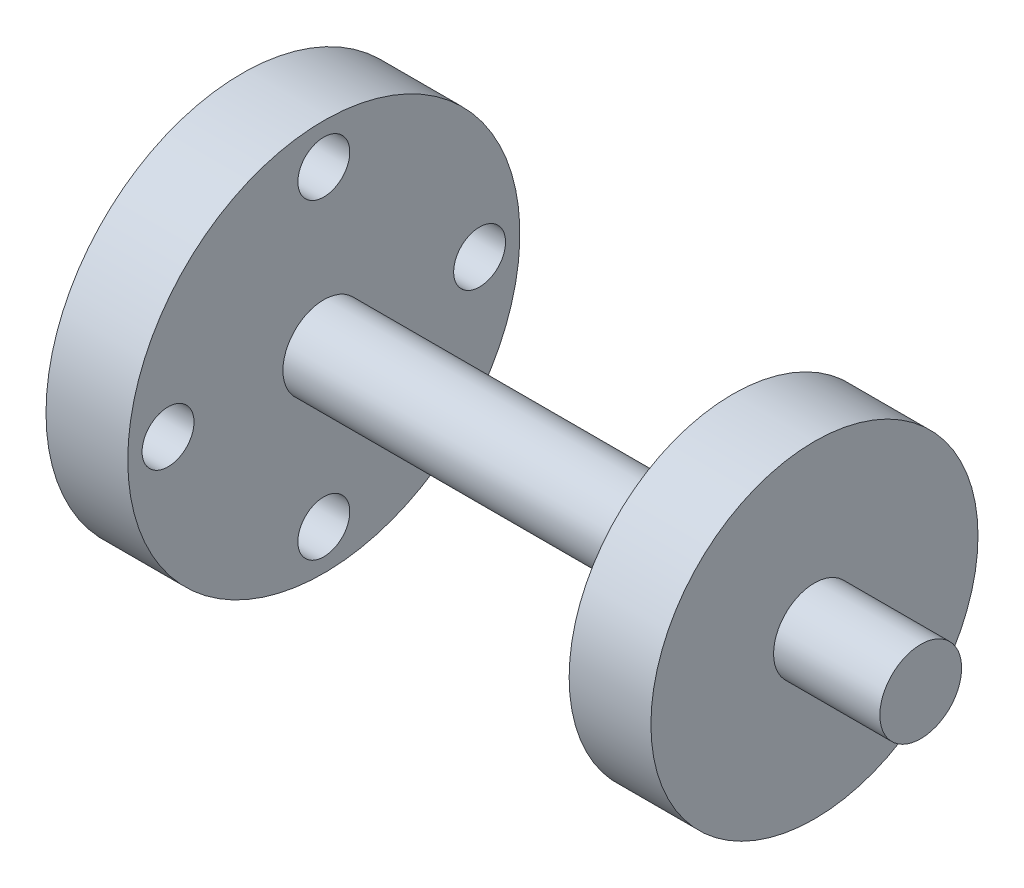
ISO-10303-21;
HEADER;
FILE_DESCRIPTION(('STEP AP214'),'2;1');
FILE_NAME('part.step','',(''),(''),'','','');
FILE_SCHEMA(('AUTOMOTIVE_DESIGN { 1 0 10303 214 1 1 1 1 }'));
ENDSEC;
DATA;
#1=APPLICATION_CONTEXT('core data for automotive mechanical design processes');
#2=APPLICATION_PROTOCOL_DEFINITION('international standard','automotive_design',2000,#1);
#3=PRODUCT_CONTEXT('',#1,'mechanical');
#4=PRODUCT('Part','Part','',(#3));
#5=PRODUCT_RELATED_PRODUCT_CATEGORY('part','',(#4));
#6=PRODUCT_DEFINITION_FORMATION('','',#4);
#7=PRODUCT_DEFINITION_CONTEXT('part definition',#1,'design');
#8=PRODUCT_DEFINITION('design','',#6,#7);
#9=PRODUCT_DEFINITION_SHAPE('','',#8);
#10=(LENGTH_UNIT() NAMED_UNIT(*) SI_UNIT(.MILLI.,.METRE.));
#11=(NAMED_UNIT(*) PLANE_ANGLE_UNIT() SI_UNIT($,.RADIAN.));
#12=(NAMED_UNIT(*) SI_UNIT($,.STERADIAN.) SOLID_ANGLE_UNIT());
#13=UNCERTAINTY_MEASURE_WITH_UNIT(LENGTH_MEASURE(1.E-05),#10,'distance_accuracy_value','');
#14=(GEOMETRIC_REPRESENTATION_CONTEXT(3) GLOBAL_UNCERTAINTY_ASSIGNED_CONTEXT((#13)) GLOBAL_UNIT_ASSIGNED_CONTEXT((#10,
#11,#12)) REPRESENTATION_CONTEXT('',''));
#15=CARTESIAN_POINT('',(0.,0.,0.));
#16=DIRECTION('',(0.,0.,1.));
#17=DIRECTION('',(1.,0.,0.));
#18=AXIS2_PLACEMENT_3D('',#15,#16,#17);
#19=CARTESIAN_POINT('',(83.,5.,0.));
#20=DIRECTION('',(-1.,0.,0.));
#21=DIRECTION('',(0.,0.,1.));
#22=AXIS2_PLACEMENT_3D('',#19,#20,#21);
#23=PLANE('',#22);
#24=CARTESIAN_POINT('',(83.,0.,0.));
#25=DIRECTION('',(-1.,0.,0.));
#26=DIRECTION('',(0.,0.,1.));
#27=AXIS2_PLACEMENT_3D('',#24,#25,#26);
#28=CIRCLE('',#27,5.);
#29=CARTESIAN_POINT('',(83.,0.,5.));
#30=VERTEX_POINT('',#29);
#31=EDGE_CURVE('E10',#30,#30,#28,.T.);
#32=ORIENTED_EDGE('',*,*,#31,.F.);
#33=EDGE_LOOP('',(#32));
#34=FACE_BOUND('',#33,.T.);
#35=ADVANCED_FACE('F43',(#34),#23,.F.);
#36=CARTESIAN_POINT('',(0.,0.,0.));
#37=DIRECTION('',(-1.,0.,0.));
#38=DIRECTION('',(0.,0.,1.));
#39=AXIS2_PLACEMENT_3D('',#36,#37,#38);
#40=CYLINDRICAL_SURFACE('',#39,5.);
#41=CARTESIAN_POINT('',(70.,0.,0.));
#42=DIRECTION('',(-1.,0.,0.));
#43=DIRECTION('',(0.,0.,1.));
#44=AXIS2_PLACEMENT_3D('',#41,#42,#43);
#45=CIRCLE('',#44,5.);
#46=CARTESIAN_POINT('',(70.,0.,5.));
#47=VERTEX_POINT('',#46);
#48=EDGE_CURVE('E50',#47,#47,#45,.T.);
#49=ORIENTED_EDGE('',*,*,#48,.F.);
#50=EDGE_LOOP('',(#49));
#51=FACE_BOUND('',#50,.T.);
#52=ORIENTED_EDGE('',*,*,#31,.T.);
#53=EDGE_LOOP('',(#52));
#54=FACE_BOUND('',#53,.T.);
#55=ADVANCED_FACE('F169',(#51,#54),#40,.T.);
#56=CARTESIAN_POINT('',(70.,5.,0.));
#57=DIRECTION('',(-1.,0.,0.));
#58=DIRECTION('',(0.,0.,1.));
#59=AXIS2_PLACEMENT_3D('',#56,#57,#58);
#60=PLANE('',#59);
#61=CARTESIAN_POINT('',(70.,0.,0.));
#62=DIRECTION('',(-1.,0.,0.));
#63=DIRECTION('',(0.,0.,1.));
#64=AXIS2_PLACEMENT_3D('',#61,#62,#63);
#65=CIRCLE('',#64,20.);
#66=CARTESIAN_POINT('',(70.,0.,20.));
#67=VERTEX_POINT('',#66);
#68=EDGE_CURVE('E55',#67,#67,#65,.T.);
#69=ORIENTED_EDGE('',*,*,#68,.F.);
#70=EDGE_LOOP('',(#69));
#71=FACE_BOUND('',#70,.T.);
#72=ORIENTED_EDGE('',*,*,#48,.T.);
#73=EDGE_LOOP('',(#72));
#74=FACE_BOUND('',#73,.T.);
#75=ADVANCED_FACE('F164',(#71,#74),#60,.F.);
#76=CARTESIAN_POINT('',(0.,0.,0.));
#77=DIRECTION('',(-1.,0.,0.));
#78=DIRECTION('',(0.,0.,1.));
#79=AXIS2_PLACEMENT_3D('',#76,#77,#78);
#80=CYLINDRICAL_SURFACE('',#79,20.);
#81=CARTESIAN_POINT('',(60.,0.,0.));
#82=DIRECTION('',(-1.,0.,0.));
#83=DIRECTION('',(0.,0.,1.));
#84=AXIS2_PLACEMENT_3D('',#81,#82,#83);
#85=CIRCLE('',#84,20.);
#86=CARTESIAN_POINT('',(60.,0.,20.));
#87=VERTEX_POINT('',#86);
#88=EDGE_CURVE('E60',#87,#87,#85,.T.);
#89=ORIENTED_EDGE('',*,*,#88,.F.);
#90=EDGE_LOOP('',(#89));
#91=FACE_BOUND('',#90,.T.);
#92=ORIENTED_EDGE('',*,*,#68,.T.);
#93=EDGE_LOOP('',(#92));
#94=FACE_BOUND('',#93,.T.);
#95=ADVANCED_FACE('F158',(#91,#94),#80,.T.);
#96=CARTESIAN_POINT('',(60.,20.,0.));
#97=DIRECTION('',(1.,0.,0.));
#98=DIRECTION('',(0.,0.,-1.));
#99=AXIS2_PLACEMENT_3D('',#96,#97,#98);
#100=PLANE('',#99);
#101=CARTESIAN_POINT('',(60.,0.,0.));
#102=DIRECTION('',(-1.,0.,0.));
#103=DIRECTION('',(0.,0.,1.));
#104=AXIS2_PLACEMENT_3D('',#101,#102,#103);
#105=CIRCLE('',#104,5.);
#106=CARTESIAN_POINT('',(60.,0.,5.));
#107=VERTEX_POINT('',#106);
#108=EDGE_CURVE('E66',#107,#107,#105,.T.);
#109=ORIENTED_EDGE('',*,*,#108,.F.);
#110=EDGE_LOOP('',(#109));
#111=FACE_BOUND('',#110,.T.);
#112=ORIENTED_EDGE('',*,*,#88,.T.);
#113=EDGE_LOOP('',(#112));
#114=FACE_BOUND('',#113,.T.);
#115=ADVANCED_FACE('F152',(#111,#114),#100,.F.);
#116=CARTESIAN_POINT('',(0.,0.,0.));
#117=DIRECTION('',(-1.,0.,0.));
#118=DIRECTION('',(0.,0.,1.));
#119=AXIS2_PLACEMENT_3D('',#116,#117,#118);
#120=CYLINDRICAL_SURFACE('',#119,4.99999999999999);
#121=CARTESIAN_POINT('',(9.99999999999999,0.,0.));
#122=DIRECTION('',(-1.,0.,0.));
#123=DIRECTION('',(0.,0.,1.));
#124=AXIS2_PLACEMENT_3D('',#121,#122,#123);
#125=CIRCLE('',#124,4.99999999999999);
#126=CARTESIAN_POINT('',(9.99999999999999,0.,4.99999999999999));
#127=VERTEX_POINT('',#126);
#128=EDGE_CURVE('E70',#127,#127,#125,.T.);
#129=ORIENTED_EDGE('',*,*,#128,.F.);
#130=EDGE_LOOP('',(#129));
#131=FACE_BOUND('',#130,.T.);
#132=ORIENTED_EDGE('',*,*,#108,.T.);
#133=EDGE_LOOP('',(#132));
#134=FACE_BOUND('',#133,.T.);
#135=ADVANCED_FACE('F146',(#131,#134),#120,.T.);
#136=CARTESIAN_POINT('',(9.99999999999999,4.99999999999999,0.));
#137=DIRECTION('',(-1.,0.,0.));
#138=DIRECTION('',(0.,0.,1.));
#139=AXIS2_PLACEMENT_3D('',#136,#137,#138);
#140=PLANE('',#139);
#141=CARTESIAN_POINT('',(10.,19.05,0.));
#142=DIRECTION('',(-1.,0.,0.));
#143=DIRECTION('',(0.,0.,1.));
#144=AXIS2_PLACEMENT_3D('',#141,#142,#143);
#145=CIRCLE('',#144,3.175);
#146=CARTESIAN_POINT('',(10.,19.05,3.175));
#147=VERTEX_POINT('',#146);
#148=EDGE_CURVE('E82',#147,#147,#145,.T.);
#149=ORIENTED_EDGE('',*,*,#148,.T.);
#150=EDGE_LOOP('',(#149));
#151=FACE_BOUND('',#150,.T.);
#152=CARTESIAN_POINT('',(10.,0.,19.05));
#153=DIRECTION('',(-1.,0.,0.));
#154=DIRECTION('',(0.,0.,1.));
#155=AXIS2_PLACEMENT_3D('',#152,#153,#154);
#156=CIRCLE('',#155,3.175);
#157=CARTESIAN_POINT('',(10.,0.,22.225));
#158=VERTEX_POINT('',#157);
#159=EDGE_CURVE('E99',#158,#158,#156,.T.);
#160=ORIENTED_EDGE('',*,*,#159,.T.);
#161=EDGE_LOOP('',(#160));
#162=FACE_BOUND('',#161,.T.);
#163=CARTESIAN_POINT('',(10.,-19.05,-1.33025439009923E-13));
#164=DIRECTION('',(-1.,0.,0.));
#165=DIRECTION('',(0.,0.,1.));
#166=AXIS2_PLACEMENT_3D('',#163,#164,#165);
#167=CIRCLE('',#166,3.175);
#168=CARTESIAN_POINT('',(10.,-19.05,3.17499999999987));
#169=VERTEX_POINT('',#168);
#170=EDGE_CURVE('E91',#169,#169,#167,.T.);
#171=ORIENTED_EDGE('',*,*,#170,.T.);
#172=EDGE_LOOP('',(#171));
#173=FACE_BOUND('',#172,.T.);
#174=CARTESIAN_POINT('',(10.,1.99538158514885E-13,-19.05));
#175=DIRECTION('',(-1.,0.,0.));
#176=DIRECTION('',(0.,0.,1.));
#177=AXIS2_PLACEMENT_3D('',#174,#175,#176);
#178=CIRCLE('',#177,3.175);
#179=CARTESIAN_POINT('',(10.,1.99538158514885E-13,-15.875));
#180=VERTEX_POINT('',#179);
#181=EDGE_CURVE('E83',#180,#180,#178,.T.);
#182=ORIENTED_EDGE('',*,*,#181,.T.);
#183=EDGE_LOOP('',(#182));
#184=FACE_BOUND('',#183,.T.);
#185=CARTESIAN_POINT('',(9.99999999999999,0.,0.));
#186=DIRECTION('',(-1.,0.,0.));
#187=DIRECTION('',(0.,0.,1.));
#188=AXIS2_PLACEMENT_3D('',#185,#186,#187);
#189=CIRCLE('',#188,23.975);
#190=CARTESIAN_POINT('',(9.99999999999999,0.,23.975));
#191=VERTEX_POINT('',#190);
#192=EDGE_CURVE('E74',#191,#191,#189,.T.);
#193=ORIENTED_EDGE('',*,*,#192,.F.);
#194=EDGE_LOOP('',(#193));
#195=FACE_BOUND('',#194,.T.);
#196=ORIENTED_EDGE('',*,*,#128,.T.);
#197=EDGE_LOOP('',(#196));
#198=FACE_BOUND('',#197,.T.);
#199=ADVANCED_FACE('F115',(#151,#162,#173,#184,#195,#198),#140,.F.);
#200=CARTESIAN_POINT('',(0.,0.,0.));
#201=DIRECTION('',(-1.,0.,0.));
#202=DIRECTION('',(0.,0.,1.));
#203=AXIS2_PLACEMENT_3D('',#200,#201,#202);
#204=CYLINDRICAL_SURFACE('',#203,23.975);
#205=CARTESIAN_POINT('',(0.,0.,0.));
#206=DIRECTION('',(-1.,0.,0.));
#207=DIRECTION('',(0.,0.,1.));
#208=AXIS2_PLACEMENT_3D('',#205,#206,#207);
#209=CIRCLE('',#208,23.975);
#210=CARTESIAN_POINT('',(0.,0.,23.975));
#211=VERTEX_POINT('',#210);
#212=EDGE_CURVE('E78',#211,#211,#209,.T.);
#213=ORIENTED_EDGE('',*,*,#212,.F.);
#214=EDGE_LOOP('',(#213));
#215=FACE_BOUND('',#214,.T.);
#216=ORIENTED_EDGE('',*,*,#192,.T.);
#217=EDGE_LOOP('',(#216));
#218=FACE_BOUND('',#217,.T.);
#219=ADVANCED_FACE('F129',(#215,#218),#204,.T.);
#220=CARTESIAN_POINT('',(0.,23.975,0.));
#221=DIRECTION('',(1.,0.,0.));
#222=DIRECTION('',(0.,0.,-1.));
#223=AXIS2_PLACEMENT_3D('',#220,#221,#222);
#224=PLANE('',#223);
#225=CARTESIAN_POINT('',(0.,19.05,0.));
#226=DIRECTION('',(-1.,0.,0.));
#227=DIRECTION('',(0.,0.,1.));
#228=AXIS2_PLACEMENT_3D('',#225,#226,#227);
#229=CIRCLE('',#228,3.175);
#230=CARTESIAN_POINT('',(0.,19.05,3.175));
#231=VERTEX_POINT('',#230);
#232=EDGE_CURVE('E107',#231,#231,#229,.T.);
#233=ORIENTED_EDGE('',*,*,#232,.F.);
#234=EDGE_LOOP('',(#233));
#235=FACE_BOUND('',#234,.T.);
#236=CARTESIAN_POINT('',(0.,0.,19.05));
#237=DIRECTION('',(-1.,0.,0.));
#238=DIRECTION('',(0.,0.,1.));
#239=AXIS2_PLACEMENT_3D('',#236,#237,#238);
#240=CIRCLE('',#239,3.175);
#241=CARTESIAN_POINT('',(0.,0.,22.225));
#242=VERTEX_POINT('',#241);
#243=EDGE_CURVE('E103',#242,#242,#240,.T.);
#244=ORIENTED_EDGE('',*,*,#243,.F.);
#245=EDGE_LOOP('',(#244));
#246=FACE_BOUND('',#245,.T.);
#247=CARTESIAN_POINT('',(0.,-19.05,-1.33025439009923E-13));
#248=DIRECTION('',(-1.,0.,0.));
#249=DIRECTION('',(0.,0.,1.));
#250=AXIS2_PLACEMENT_3D('',#247,#248,#249);
#251=CIRCLE('',#250,3.175);
#252=CARTESIAN_POINT('',(0.,-19.05,3.17499999999987));
#253=VERTEX_POINT('',#252);
#254=EDGE_CURVE('E95',#253,#253,#251,.T.);
#255=ORIENTED_EDGE('',*,*,#254,.F.);
#256=EDGE_LOOP('',(#255));
#257=FACE_BOUND('',#256,.T.);
#258=CARTESIAN_POINT('',(0.,1.99538158514885E-13,-19.05));
#259=DIRECTION('',(-1.,0.,0.));
#260=DIRECTION('',(0.,0.,1.));
#261=AXIS2_PLACEMENT_3D('',#258,#259,#260);
#262=CIRCLE('',#261,3.175);
#263=CARTESIAN_POINT('',(0.,1.99538158514885E-13,-15.875));
#264=VERTEX_POINT('',#263);
#265=EDGE_CURVE('E87',#264,#264,#262,.T.);
#266=ORIENTED_EDGE('',*,*,#265,.F.);
#267=EDGE_LOOP('',(#266));
#268=FACE_BOUND('',#267,.T.);
#269=ORIENTED_EDGE('',*,*,#212,.T.);
#270=EDGE_LOOP('',(#269));
#271=FACE_BOUND('',#270,.T.);
#272=ADVANCED_FACE('F125',(#235,#246,#257,#268,#271),#224,.F.);
#273=CARTESIAN_POINT('',(10.,1.99538158514885E-13,-19.05));
#274=DIRECTION('',(-1.,0.,0.));
#275=DIRECTION('',(0.,0.,1.));
#276=AXIS2_PLACEMENT_3D('',#273,#274,#275);
#277=CYLINDRICAL_SURFACE('',#276,3.175);
#278=ORIENTED_EDGE('',*,*,#181,.F.);
#279=EDGE_LOOP('',(#278));
#280=FACE_BOUND('',#279,.T.);
#281=ORIENTED_EDGE('',*,*,#265,.T.);
#282=EDGE_LOOP('',(#281));
#283=FACE_BOUND('',#282,.T.);
#284=ADVANCED_FACE('F128',(#280,#283),#277,.F.);
#285=CARTESIAN_POINT('',(10.,-19.05,-1.33025439009923E-13));
#286=DIRECTION('',(-1.,0.,0.));
#287=DIRECTION('',(0.,0.,1.));
#288=AXIS2_PLACEMENT_3D('',#285,#286,#287);
#289=CYLINDRICAL_SURFACE('',#288,3.175);
#290=ORIENTED_EDGE('',*,*,#170,.F.);
#291=EDGE_LOOP('',(#290));
#292=FACE_BOUND('',#291,.T.);
#293=ORIENTED_EDGE('',*,*,#254,.T.);
#294=EDGE_LOOP('',(#293));
#295=FACE_BOUND('',#294,.T.);
#296=ADVANCED_FACE('F234',(#292,#295),#289,.F.);
#297=CARTESIAN_POINT('',(10.,0.,19.05));
#298=DIRECTION('',(-1.,0.,0.));
#299=DIRECTION('',(0.,0.,1.));
#300=AXIS2_PLACEMENT_3D('',#297,#298,#299);
#301=CYLINDRICAL_SURFACE('',#300,3.175);
#302=ORIENTED_EDGE('',*,*,#159,.F.);
#303=EDGE_LOOP('',(#302));
#304=FACE_BOUND('',#303,.T.);
#305=ORIENTED_EDGE('',*,*,#243,.T.);
#306=EDGE_LOOP('',(#305));
#307=FACE_BOUND('',#306,.T.);
#308=ADVANCED_FACE('F121',(#304,#307),#301,.F.);
#309=CARTESIAN_POINT('',(10.,19.05,0.));
#310=DIRECTION('',(-1.,0.,0.));
#311=DIRECTION('',(0.,0.,1.));
#312=AXIS2_PLACEMENT_3D('',#309,#310,#311);
#313=CYLINDRICAL_SURFACE('',#312,3.175);
#314=ORIENTED_EDGE('',*,*,#148,.F.);
#315=EDGE_LOOP('',(#314));
#316=FACE_BOUND('',#315,.T.);
#317=ORIENTED_EDGE('',*,*,#232,.T.);
#318=EDGE_LOOP('',(#317));
#319=FACE_BOUND('',#318,.T.);
#320=ADVANCED_FACE('F118',(#316,#319),#313,.F.);
#321=CLOSED_SHELL('',(#35,#55,#75,#95,#115,#135,#199,#219,#272,#284,#296,#308,#320));
#322=MANIFOLD_SOLID_BREP('B2',#321);
#323=ADVANCED_BREP_SHAPE_REPRESENTATION('',(#18,#322),#14);
#324=SHAPE_DEFINITION_REPRESENTATION(#9,#323);
ENDSEC;
END-ISO-10303-21;
